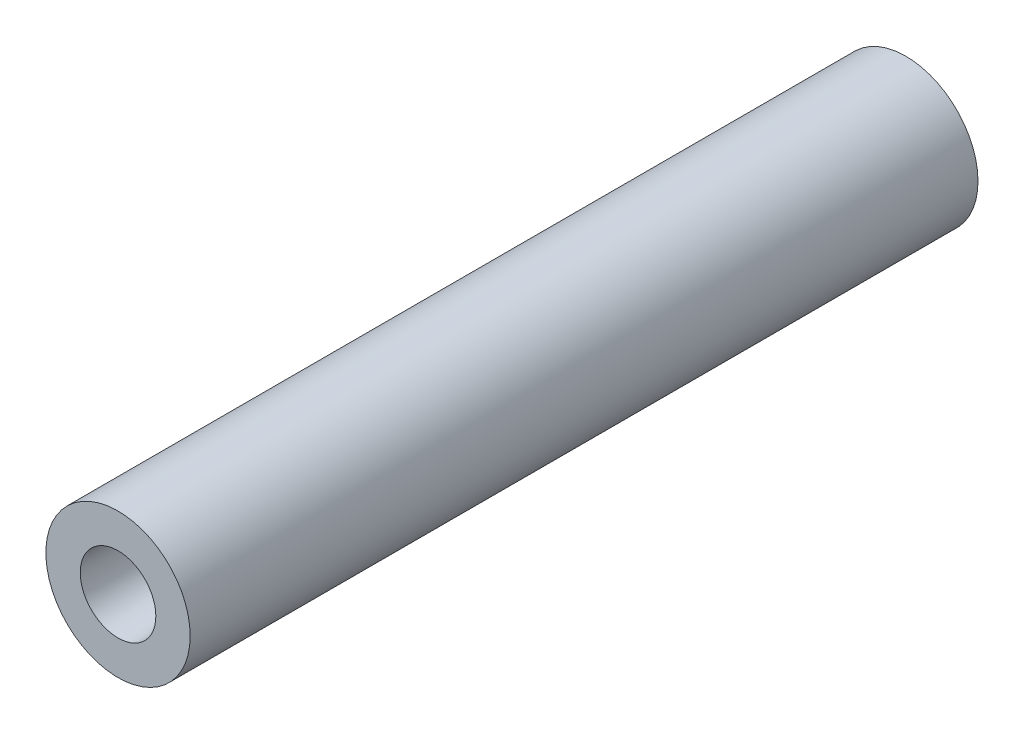
ISO-10303-21;
HEADER;
FILE_DESCRIPTION(('STEP AP214'),'2;1');
FILE_NAME('part.step','',(''),(''),'','','');
FILE_SCHEMA(('AUTOMOTIVE_DESIGN { 1 0 10303 214 1 1 1 1 }'));
ENDSEC;
DATA;
#1=APPLICATION_CONTEXT('core data for automotive mechanical design processes');
#2=APPLICATION_PROTOCOL_DEFINITION('international standard','automotive_design',2000,#1);
#3=PRODUCT_CONTEXT('',#1,'mechanical');
#4=PRODUCT('Part','Part','',(#3));
#5=PRODUCT_RELATED_PRODUCT_CATEGORY('part','',(#4));
#6=PRODUCT_DEFINITION_FORMATION('','',#4);
#7=PRODUCT_DEFINITION_CONTEXT('part definition',#1,'design');
#8=PRODUCT_DEFINITION('design','',#6,#7);
#9=PRODUCT_DEFINITION_SHAPE('','',#8);
#10=(LENGTH_UNIT() NAMED_UNIT(*) SI_UNIT(.MILLI.,.METRE.));
#11=(NAMED_UNIT(*) PLANE_ANGLE_UNIT() SI_UNIT($,.RADIAN.));
#12=(NAMED_UNIT(*) SI_UNIT($,.STERADIAN.) SOLID_ANGLE_UNIT());
#13=UNCERTAINTY_MEASURE_WITH_UNIT(LENGTH_MEASURE(1.E-05),#10,'distance_accuracy_value','');
#14=(GEOMETRIC_REPRESENTATION_CONTEXT(3) GLOBAL_UNCERTAINTY_ASSIGNED_CONTEXT((#13)) GLOBAL_UNIT_ASSIGNED_CONTEXT((#10,
#11,#12)) REPRESENTATION_CONTEXT('',''));
#15=CARTESIAN_POINT('',(0.,0.,0.));
#16=DIRECTION('',(0.,0.,1.));
#17=DIRECTION('',(1.,0.,0.));
#18=AXIS2_PLACEMENT_3D('',#15,#16,#17);
#19=CARTESIAN_POINT('',(0.,0.,65.5));
#20=DIRECTION('',(0.,0.,-1.));
#21=DIRECTION('',(-1.,0.,0.));
#22=AXIS2_PLACEMENT_3D('',#19,#20,#21);
#23=CYLINDRICAL_SURFACE('',#22,1.);
#24=CARTESIAN_POINT('',(0.,0.,9.0297));
#25=DIRECTION('',(0.,0.,1.));
#26=DIRECTION('',(1.,0.,0.));
#27=AXIS2_PLACEMENT_3D('',#24,#25,#26);
#28=CIRCLE('',#27,1.);
#29=CARTESIAN_POINT('',(1.,0.,9.0297));
#30=VERTEX_POINT('',#29);
#31=EDGE_CURVE('E48',#30,#30,#28,.T.);
#32=ORIENTED_EDGE('',*,*,#31,.F.);
#33=EDGE_LOOP('',(#32));
#34=FACE_BOUND('',#33,.T.);
#35=CARTESIAN_POINT('',(0.,0.,56.4703));
#36=DIRECTION('',(0.,0.,1.));
#37=DIRECTION('',(1.,0.,0.));
#38=AXIS2_PLACEMENT_3D('',#35,#36,#37);
#39=CIRCLE('',#38,1.);
#40=CARTESIAN_POINT('',(1.,0.,56.4703));
#41=VERTEX_POINT('',#40);
#42=EDGE_CURVE('E39',#41,#41,#39,.T.);
#43=ORIENTED_EDGE('',*,*,#42,.T.);
#44=EDGE_LOOP('',(#43));
#45=FACE_BOUND('',#44,.T.);
#46=ADVANCED_FACE('F35',(#34,#45),#23,.F.);
#47=CARTESIAN_POINT('',(0.,0.,65.5));
#48=DIRECTION('',(0.,0.,-1.));
#49=DIRECTION('',(-1.,0.,0.));
#50=AXIS2_PLACEMENT_3D('',#47,#48,#49);
#51=CYLINDRICAL_SURFACE('',#50,6.);
#52=CARTESIAN_POINT('',(0.,0.,65.5));
#53=DIRECTION('',(0.,0.,1.));
#54=DIRECTION('',(1.,0.,0.));
#55=AXIS2_PLACEMENT_3D('',#52,#53,#54);
#56=CIRCLE('',#55,6.);
#57=CARTESIAN_POINT('',(6.,0.,65.5));
#58=VERTEX_POINT('',#57);
#59=EDGE_CURVE('E10',#58,#58,#56,.T.);
#60=ORIENTED_EDGE('',*,*,#59,.F.);
#61=EDGE_LOOP('',(#60));
#62=FACE_BOUND('',#61,.T.);
#63=CARTESIAN_POINT('',(0.,0.,0.));
#64=DIRECTION('',(0.,0.,1.));
#65=DIRECTION('',(1.,0.,0.));
#66=AXIS2_PLACEMENT_3D('',#63,#64,#65);
#67=CIRCLE('',#66,6.);
#68=CARTESIAN_POINT('',(6.,0.,0.));
#69=VERTEX_POINT('',#68);
#70=EDGE_CURVE('E43',#69,#69,#67,.T.);
#71=ORIENTED_EDGE('',*,*,#70,.T.);
#72=EDGE_LOOP('',(#71));
#73=FACE_BOUND('',#72,.T.);
#74=ADVANCED_FACE('F37',(#62,#73),#51,.T.);
#75=CARTESIAN_POINT('',(0.,0.,65.5));
#76=DIRECTION('',(0.,0.,1.));
#77=DIRECTION('',(1.,0.,0.));
#78=AXIS2_PLACEMENT_3D('',#75,#76,#77);
#79=PLANE('',#78);
#80=CARTESIAN_POINT('',(0.,0.,65.5));
#81=DIRECTION('',(0.,0.,1.));
#82=DIRECTION('',(1.,0.,0.));
#83=AXIS2_PLACEMENT_3D('',#80,#81,#82);
#84=CIRCLE('',#83,3.14325);
#85=CARTESIAN_POINT('',(3.14325,0.,65.5));
#86=VERTEX_POINT('',#85);
#87=EDGE_CURVE('E68',#86,#86,#84,.T.);
#88=ORIENTED_EDGE('',*,*,#87,.F.);
#89=EDGE_LOOP('',(#88));
#90=FACE_BOUND('',#89,.T.);
#91=ORIENTED_EDGE('',*,*,#59,.T.);
#92=EDGE_LOOP('',(#91));
#93=FACE_BOUND('',#92,.T.);
#94=ADVANCED_FACE('F74',(#90,#93),#79,.T.);
#95=CARTESIAN_POINT('',(0.,0.,0.));
#96=DIRECTION('',(0.,0.,1.));
#97=DIRECTION('',(1.,0.,0.));
#98=AXIS2_PLACEMENT_3D('',#95,#96,#97);
#99=PLANE('',#98);
#100=CARTESIAN_POINT('',(0.,0.,0.));
#101=DIRECTION('',(0.,0.,1.));
#102=DIRECTION('',(1.,0.,0.));
#103=AXIS2_PLACEMENT_3D('',#100,#101,#102);
#104=CIRCLE('',#103,3.14325);
#105=CARTESIAN_POINT('',(3.14325,0.,0.));
#106=VERTEX_POINT('',#105);
#107=EDGE_CURVE('E57',#106,#106,#104,.T.);
#108=ORIENTED_EDGE('',*,*,#107,.T.);
#109=EDGE_LOOP('',(#108));
#110=FACE_BOUND('',#109,.T.);
#111=ORIENTED_EDGE('',*,*,#70,.F.);
#112=EDGE_LOOP('',(#111));
#113=FACE_BOUND('',#112,.T.);
#114=ADVANCED_FACE('F76',(#110,#113),#99,.F.);
#115=CARTESIAN_POINT('',(0.,0.,0.));
#116=DIRECTION('',(0.,0.,-1.));
#117=DIRECTION('',(1.,0.,0.));
#118=AXIS2_PLACEMENT_3D('',#115,#116,#117);
#119=CONICAL_SURFACE('',#118,3.14325,0.0406312649864281);
#120=CARTESIAN_POINT('',(0.,0.,9.0297));
#121=DIRECTION('',(0.,0.,1.));
#122=DIRECTION('',(1.,0.,0.));
#123=AXIS2_PLACEMENT_3D('',#120,#121,#122);
#124=CIRCLE('',#123,2.77615983463477);
#125=CARTESIAN_POINT('',(2.77615983463477,0.,9.0297));
#126=VERTEX_POINT('',#125);
#127=EDGE_CURVE('E51',#126,#126,#124,.T.);
#128=ORIENTED_EDGE('',*,*,#127,.T.);
#129=EDGE_LOOP('',(#128));
#130=FACE_BOUND('',#129,.T.);
#131=ORIENTED_EDGE('',*,*,#107,.F.);
#132=EDGE_LOOP('',(#131));
#133=FACE_BOUND('',#132,.T.);
#134=ADVANCED_FACE('F82',(#130,#133),#119,.F.);
#135=CARTESIAN_POINT('',(0.,0.,9.0297));
#136=DIRECTION('',(0.,0.,1.));
#137=DIRECTION('',(1.,0.,0.));
#138=AXIS2_PLACEMENT_3D('',#135,#136,#137);
#139=PLANE('',#138);
#140=ORIENTED_EDGE('',*,*,#31,.T.);
#141=EDGE_LOOP('',(#140));
#142=FACE_BOUND('',#141,.T.);
#143=ORIENTED_EDGE('',*,*,#127,.F.);
#144=EDGE_LOOP('',(#143));
#145=FACE_BOUND('',#144,.T.);
#146=ADVANCED_FACE('F93',(#142,#145),#139,.F.);
#147=CARTESIAN_POINT('',(0.,0.,65.5));
#148=DIRECTION('',(0.,0.,1.));
#149=DIRECTION('',(1.,0.,0.));
#150=AXIS2_PLACEMENT_3D('',#147,#148,#149);
#151=CONICAL_SURFACE('',#150,3.14325,0.0406312649864281);
#152=CARTESIAN_POINT('',(0.,0.,56.4703));
#153=DIRECTION('',(0.,0.,1.));
#154=DIRECTION('',(1.,0.,0.));
#155=AXIS2_PLACEMENT_3D('',#152,#153,#154);
#156=CIRCLE('',#155,2.77615983463477);
#157=CARTESIAN_POINT('',(2.77615983463477,0.,56.4703));
#158=VERTEX_POINT('',#157);
#159=EDGE_CURVE('E64',#158,#158,#156,.T.);
#160=ORIENTED_EDGE('',*,*,#159,.F.);
#161=EDGE_LOOP('',(#160));
#162=FACE_BOUND('',#161,.T.);
#163=ORIENTED_EDGE('',*,*,#87,.T.);
#164=EDGE_LOOP('',(#163));
#165=FACE_BOUND('',#164,.T.);
#166=ADVANCED_FACE('F72',(#162,#165),#151,.F.);
#167=CARTESIAN_POINT('',(0.,0.,56.4703));
#168=DIRECTION('',(0.,0.,1.));
#169=DIRECTION('',(1.,0.,0.));
#170=AXIS2_PLACEMENT_3D('',#167,#168,#169);
#171=PLANE('',#170);
#172=ORIENTED_EDGE('',*,*,#42,.F.);
#173=EDGE_LOOP('',(#172));
#174=FACE_BOUND('',#173,.T.);
#175=ORIENTED_EDGE('',*,*,#159,.T.);
#176=EDGE_LOOP('',(#175));
#177=FACE_BOUND('',#176,.T.);
#178=ADVANCED_FACE('F98',(#174,#177),#171,.T.);
#179=CLOSED_SHELL('',(#46,#74,#94,#114,#134,#146,#166,#178));
#180=MANIFOLD_SOLID_BREP('B2',#179);
#181=ADVANCED_BREP_SHAPE_REPRESENTATION('',(#18,#180),#14);
#182=SHAPE_DEFINITION_REPRESENTATION(#9,#181);
ENDSEC;
END-ISO-10303-21;
